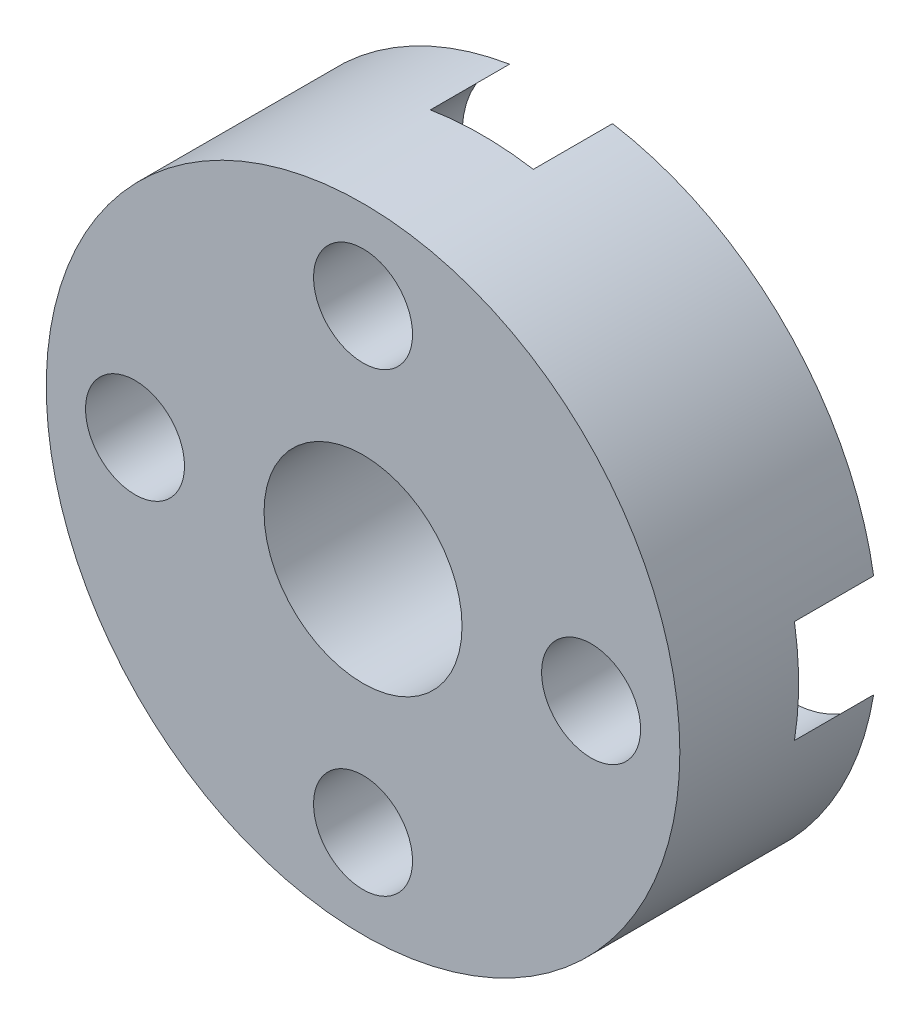
ISO-10303-21;
HEADER;
FILE_DESCRIPTION(('STEP AP214'),'2;1');
FILE_NAME('part.step','',(''),(''),'','','');
FILE_SCHEMA(('AUTOMOTIVE_DESIGN { 1 0 10303 214 1 1 1 1 }'));
ENDSEC;
DATA;
#1=APPLICATION_CONTEXT('core data for automotive mechanical design processes');
#2=APPLICATION_PROTOCOL_DEFINITION('international standard','automotive_design',2000,#1);
#3=PRODUCT_CONTEXT('',#1,'mechanical');
#4=PRODUCT('Part','Part','',(#3));
#5=PRODUCT_RELATED_PRODUCT_CATEGORY('part','',(#4));
#6=PRODUCT_DEFINITION_FORMATION('','',#4);
#7=PRODUCT_DEFINITION_CONTEXT('part definition',#1,'design');
#8=PRODUCT_DEFINITION('design','',#6,#7);
#9=PRODUCT_DEFINITION_SHAPE('','',#8);
#10=(LENGTH_UNIT() NAMED_UNIT(*) SI_UNIT(.MILLI.,.METRE.));
#11=(NAMED_UNIT(*) PLANE_ANGLE_UNIT() SI_UNIT($,.RADIAN.));
#12=(NAMED_UNIT(*) SI_UNIT($,.STERADIAN.) SOLID_ANGLE_UNIT());
#13=UNCERTAINTY_MEASURE_WITH_UNIT(LENGTH_MEASURE(1.E-05),#10,'distance_accuracy_value','');
#14=(GEOMETRIC_REPRESENTATION_CONTEXT(3) GLOBAL_UNCERTAINTY_ASSIGNED_CONTEXT((#13)) GLOBAL_UNIT_ASSIGNED_CONTEXT((#10,
#11,#12)) REPRESENTATION_CONTEXT('',''));
#15=CARTESIAN_POINT('',(0.,0.,0.));
#16=DIRECTION('',(0.,0.,1.));
#17=DIRECTION('',(1.,0.,0.));
#18=AXIS2_PLACEMENT_3D('',#15,#16,#17);
#19=CARTESIAN_POINT('',(-420.454135705833,67.4246299468758,5.));
#20=DIRECTION('',(0.,0.,-1.));
#21=DIRECTION('',(-1.,0.,0.));
#22=AXIS2_PLACEMENT_3D('',#19,#20,#21);
#23=CYLINDRICAL_SURFACE('',#22,1.24999999999995);
#24=CARTESIAN_POINT('',(-420.454135705833,67.4246299468758,5.));
#25=DIRECTION('',(0.,0.,1.));
#26=DIRECTION('',(1.,0.,0.));
#27=AXIS2_PLACEMENT_3D('',#24,#25,#26);
#28=CIRCLE('',#27,1.24999999999995);
#29=CARTESIAN_POINT('',(-419.204135705833,67.4246299468758,5.));
#30=VERTEX_POINT('',#29);
#31=EDGE_CURVE('E180',#30,#30,#28,.T.);
#32=ORIENTED_EDGE('',*,*,#31,.T.);
#33=EDGE_LOOP('',(#32));
#34=FACE_BOUND('',#33,.T.);
#35=CARTESIAN_POINT('',(-420.454135705833,67.4246299468758,2.));
#36=DIRECTION('',(0.,0.,-1.));
#37=DIRECTION('',(-1.,0.,0.));
#38=AXIS2_PLACEMENT_3D('',#35,#36,#37);
#39=CIRCLE('',#38,1.24999999999995);
#40=CARTESIAN_POINT('',(-421.704135705833,67.4246299468758,2.));
#41=VERTEX_POINT('',#40);
#42=EDGE_CURVE('E147',#41,#41,#39,.T.);
#43=ORIENTED_EDGE('',*,*,#42,.T.);
#44=EDGE_LOOP('',(#43));
#45=FACE_BOUND('',#44,.T.);
#46=ADVANCED_FACE('F38',(#34,#45),#23,.F.);
#47=CARTESIAN_POINT('',(-414.695869084725,61.6663633257672,5.));
#48=DIRECTION('',(0.,0.,-1.));
#49=DIRECTION('',(-1.,0.,0.));
#50=AXIS2_PLACEMENT_3D('',#47,#48,#49);
#51=CYLINDRICAL_SURFACE('',#50,1.24999999999996);
#52=CARTESIAN_POINT('',(-414.695869084725,61.6663633257672,5.));
#53=DIRECTION('',(0.,0.,1.));
#54=DIRECTION('',(1.,0.,0.));
#55=AXIS2_PLACEMENT_3D('',#52,#53,#54);
#56=CIRCLE('',#55,1.24999999999996);
#57=CARTESIAN_POINT('',(-413.445869084725,61.6663633257672,5.));
#58=VERTEX_POINT('',#57);
#59=EDGE_CURVE('E177',#58,#58,#56,.T.);
#60=ORIENTED_EDGE('',*,*,#59,.T.);
#61=EDGE_LOOP('',(#60));
#62=FACE_BOUND('',#61,.T.);
#63=CARTESIAN_POINT('',(-414.695869084725,61.6663633257672,2.));
#64=DIRECTION('',(0.,0.,-1.));
#65=DIRECTION('',(-1.,0.,0.));
#66=AXIS2_PLACEMENT_3D('',#63,#64,#65);
#67=CIRCLE('',#66,1.24999999999996);
#68=CARTESIAN_POINT('',(-415.945869084725,61.6663633257672,2.));
#69=VERTEX_POINT('',#68);
#70=EDGE_CURVE('E143',#69,#69,#67,.T.);
#71=ORIENTED_EDGE('',*,*,#70,.T.);
#72=EDGE_LOOP('',(#71));
#73=FACE_BOUND('',#72,.T.);
#74=ADVANCED_FACE('F202',(#62,#73),#51,.F.);
#75=CARTESIAN_POINT('',(-420.454135705833,55.9080967046586,5.));
#76=DIRECTION('',(0.,0.,-1.));
#77=DIRECTION('',(-1.,0.,0.));
#78=AXIS2_PLACEMENT_3D('',#75,#76,#77);
#79=CYLINDRICAL_SURFACE('',#78,1.24999999999996);
#80=CARTESIAN_POINT('',(-420.454135705833,55.9080967046586,5.));
#81=DIRECTION('',(0.,0.,1.));
#82=DIRECTION('',(1.,0.,0.));
#83=AXIS2_PLACEMENT_3D('',#80,#81,#82);
#84=CIRCLE('',#83,1.24999999999996);
#85=CARTESIAN_POINT('',(-419.204135705833,55.9080967046586,5.));
#86=VERTEX_POINT('',#85);
#87=EDGE_CURVE('E174',#86,#86,#84,.T.);
#88=ORIENTED_EDGE('',*,*,#87,.T.);
#89=EDGE_LOOP('',(#88));
#90=FACE_BOUND('',#89,.T.);
#91=CARTESIAN_POINT('',(-420.454135705833,55.9080967046586,2.));
#92=DIRECTION('',(0.,0.,-1.));
#93=DIRECTION('',(-1.,0.,0.));
#94=AXIS2_PLACEMENT_3D('',#91,#92,#93);
#95=CIRCLE('',#94,1.24999999999996);
#96=CARTESIAN_POINT('',(-421.704135705833,55.9080967046586,2.));
#97=VERTEX_POINT('',#96);
#98=EDGE_CURVE('E139',#97,#97,#95,.T.);
#99=ORIENTED_EDGE('',*,*,#98,.T.);
#100=EDGE_LOOP('',(#99));
#101=FACE_BOUND('',#100,.T.);
#102=ADVANCED_FACE('F207',(#90,#101),#79,.F.);
#103=CARTESIAN_POINT('',(-426.212402326942,61.6663633257672,5.));
#104=DIRECTION('',(0.,0.,-1.));
#105=DIRECTION('',(-1.,0.,0.));
#106=AXIS2_PLACEMENT_3D('',#103,#104,#105);
#107=CYLINDRICAL_SURFACE('',#106,1.24999999999996);
#108=CARTESIAN_POINT('',(-426.212402326942,61.6663633257672,5.));
#109=DIRECTION('',(0.,0.,1.));
#110=DIRECTION('',(1.,0.,0.));
#111=AXIS2_PLACEMENT_3D('',#108,#109,#110);
#112=CIRCLE('',#111,1.24999999999996);
#113=CARTESIAN_POINT('',(-424.962402326942,61.6663633257672,5.));
#114=VERTEX_POINT('',#113);
#115=EDGE_CURVE('E171',#114,#114,#112,.T.);
#116=ORIENTED_EDGE('',*,*,#115,.T.);
#117=EDGE_LOOP('',(#116));
#118=FACE_BOUND('',#117,.T.);
#119=CARTESIAN_POINT('',(-426.212402326942,61.6663633257672,2.));
#120=DIRECTION('',(0.,0.,-1.));
#121=DIRECTION('',(-1.,0.,0.));
#122=AXIS2_PLACEMENT_3D('',#119,#120,#121);
#123=CIRCLE('',#122,1.24999999999996);
#124=CARTESIAN_POINT('',(-427.462402326942,61.6663633257672,2.));
#125=VERTEX_POINT('',#124);
#126=EDGE_CURVE('E135',#125,#125,#123,.T.);
#127=ORIENTED_EDGE('',*,*,#126,.T.);
#128=EDGE_LOOP('',(#127));
#129=FACE_BOUND('',#128,.T.);
#130=ADVANCED_FACE('F214',(#118,#129),#107,.F.);
#131=CARTESIAN_POINT('',(-420.454135705833,61.6663633257672,5.));
#132=DIRECTION('',(0.,0.,1.));
#133=DIRECTION('',(1.,0.,0.));
#134=AXIS2_PLACEMENT_3D('',#131,#132,#133);
#135=PLANE('',#134);
#136=ORIENTED_EDGE('',*,*,#87,.F.);
#137=EDGE_LOOP('',(#136));
#138=FACE_BOUND('',#137,.T.);
#139=ORIENTED_EDGE('',*,*,#31,.F.);
#140=EDGE_LOOP('',(#139));
#141=FACE_BOUND('',#140,.T.);
#142=CARTESIAN_POINT('',(-420.454135705833,61.6663633257672,5.));
#143=DIRECTION('',(0.,0.,1.));
#144=DIRECTION('',(1.,0.,0.));
#145=AXIS2_PLACEMENT_3D('',#142,#143,#144);
#146=CIRCLE('',#145,7.99999999999998);
#147=CARTESIAN_POINT('',(-412.454135705833,61.6663633257672,5.));
#148=VERTEX_POINT('',#147);
#149=EDGE_CURVE('E130',#148,#148,#146,.T.);
#150=ORIENTED_EDGE('',*,*,#149,.T.);
#151=EDGE_LOOP('',(#150));
#152=FACE_BOUND('',#151,.T.);
#153=CARTESIAN_POINT('',(-420.454135705833,61.6663633257672,5.));
#154=DIRECTION('',(0.,0.,1.));
#155=DIRECTION('',(1.,0.,0.));
#156=AXIS2_PLACEMENT_3D('',#153,#154,#155);
#157=CIRCLE('',#156,2.50000000000002);
#158=CARTESIAN_POINT('',(-417.954135705833,61.6663633257672,5.));
#159=VERTEX_POINT('',#158);
#160=EDGE_CURVE('E184',#159,#159,#157,.T.);
#161=ORIENTED_EDGE('',*,*,#160,.F.);
#162=EDGE_LOOP('',(#161));
#163=FACE_BOUND('',#162,.T.);
#164=ORIENTED_EDGE('',*,*,#59,.F.);
#165=EDGE_LOOP('',(#164));
#166=FACE_BOUND('',#165,.T.);
#167=ORIENTED_EDGE('',*,*,#115,.F.);
#168=EDGE_LOOP('',(#167));
#169=FACE_BOUND('',#168,.T.);
#170=ADVANCED_FACE('F218',(#138,#141,#152,#163,#166,#169),#135,.T.);
#171=CARTESIAN_POINT('',(-420.454135705833,61.6663633257672,0.));
#172=DIRECTION('',(0.,0.,1.));
#173=DIRECTION('',(1.,0.,0.));
#174=AXIS2_PLACEMENT_3D('',#171,#172,#173);
#175=PLANE('',#174);
#176=CARTESIAN_POINT('',(-420.454135705833,61.6663633257672,0.));
#177=DIRECTION('',(0.,0.,1.));
#178=DIRECTION('',(1.,0.,0.));
#179=AXIS2_PLACEMENT_3D('',#176,#177,#178);
#180=CIRCLE('',#179,7.99999999999998);
#181=CARTESIAN_POINT('',(-421.75416705637,69.5600265113624,0.));
#182=VERTEX_POINT('',#181);
#183=CARTESIAN_POINT('',(-428.347798891428,62.9663946763041,0.));
#184=VERTEX_POINT('',#183);
#185=EDGE_CURVE('E118',#182,#184,#180,.T.);
#186=ORIENTED_EDGE('',*,*,#185,.F.);
#187=CARTESIAN_POINT('',(-420.454135705833,67.4246299468758,0.));
#188=DIRECTION('',(0.,0.,-1.));
#189=DIRECTION('',(-1.,0.,0.));
#190=AXIS2_PLACEMENT_3D('',#187,#188,#189);
#191=CIRCLE('',#190,2.50000000000002);
#192=CARTESIAN_POINT('',(-419.154104355296,69.5600265113624,0.));
#193=VERTEX_POINT('',#192);
#194=EDGE_CURVE('E122',#193,#182,#191,.T.);
#195=ORIENTED_EDGE('',*,*,#194,.F.);
#196=CARTESIAN_POINT('',(-412.560472520238,62.9663946763041,0.));
#197=VERTEX_POINT('',#196);
#198=EDGE_CURVE('E128',#197,#193,#180,.T.);
#199=ORIENTED_EDGE('',*,*,#198,.F.);
#200=CARTESIAN_POINT('',(-414.695869084725,61.6663633257672,0.));
#201=DIRECTION('',(0.,0.,-1.));
#202=DIRECTION('',(-1.,0.,0.));
#203=AXIS2_PLACEMENT_3D('',#200,#201,#202);
#204=CIRCLE('',#203,2.50000000000002);
#205=CARTESIAN_POINT('',(-412.560472520238,60.3663319752303,0.));
#206=VERTEX_POINT('',#205);
#207=EDGE_CURVE('E255',#206,#197,#204,.T.);
#208=ORIENTED_EDGE('',*,*,#207,.F.);
#209=CARTESIAN_POINT('',(-419.154104355296,53.772700140172,0.));
#210=VERTEX_POINT('',#209);
#211=EDGE_CURVE('E131',#210,#206,#180,.T.);
#212=ORIENTED_EDGE('',*,*,#211,.F.);
#213=CARTESIAN_POINT('',(-420.454135705833,55.9080967046586,0.));
#214=DIRECTION('',(0.,0.,-1.));
#215=DIRECTION('',(-1.,0.,0.));
#216=AXIS2_PLACEMENT_3D('',#213,#214,#215);
#217=CIRCLE('',#216,2.50000000000002);
#218=CARTESIAN_POINT('',(-421.75416705637,53.772700140172,0.));
#219=VERTEX_POINT('',#218);
#220=EDGE_CURVE('E260',#219,#210,#217,.T.);
#221=ORIENTED_EDGE('',*,*,#220,.F.);
#222=CARTESIAN_POINT('',(-428.347798891428,60.3663319752303,0.));
#223=VERTEX_POINT('',#222);
#224=EDGE_CURVE('E121',#223,#219,#180,.T.);
#225=ORIENTED_EDGE('',*,*,#224,.F.);
#226=CARTESIAN_POINT('',(-426.212402326942,61.6663633257672,0.));
#227=DIRECTION('',(0.,0.,-1.));
#228=DIRECTION('',(-1.,0.,0.));
#229=AXIS2_PLACEMENT_3D('',#226,#227,#228);
#230=CIRCLE('',#229,2.50000000000002);
#231=EDGE_CURVE('E105',#184,#223,#230,.T.);
#232=ORIENTED_EDGE('',*,*,#231,.F.);
#233=EDGE_LOOP('',(#186,#195,#199,#208,#212,#221,#225,#232));
#234=FACE_BOUND('',#233,.T.);
#235=CARTESIAN_POINT('',(-420.454135705833,61.6663633257672,0.));
#236=DIRECTION('',(0.,0.,1.));
#237=DIRECTION('',(1.,0.,0.));
#238=AXIS2_PLACEMENT_3D('',#235,#236,#237);
#239=CIRCLE('',#238,2.50000000000002);
#240=CARTESIAN_POINT('',(-417.954135705833,61.6663633257672,0.));
#241=VERTEX_POINT('',#240);
#242=EDGE_CURVE('E183',#241,#241,#239,.T.);
#243=ORIENTED_EDGE('',*,*,#242,.T.);
#244=EDGE_LOOP('',(#243));
#245=FACE_BOUND('',#244,.T.);
#246=ADVANCED_FACE('F115',(#234,#245),#175,.F.);
#247=CARTESIAN_POINT('',(-420.454135705833,61.6663633257672,5.));
#248=DIRECTION('',(0.,0.,-1.));
#249=DIRECTION('',(-1.,0.,0.));
#250=AXIS2_PLACEMENT_3D('',#247,#248,#249);
#251=CYLINDRICAL_SURFACE('',#250,7.99999999999998);
#252=ORIENTED_EDGE('',*,*,#198,.T.);
#253=DIRECTION('',(0.,0.,-1.));
#254=VECTOR('',#253,1.);
#255=CARTESIAN_POINT('',(-419.154104355296,69.5600265113624,1.));
#256=LINE('',#255,#254);
#257=CARTESIAN_POINT('',(-419.154104355296,69.5600265113624,2.));
#258=VERTEX_POINT('',#257);
#259=EDGE_CURVE('E11',#193,#258,#256,.F.);
#260=ORIENTED_EDGE('',*,*,#259,.T.);
#261=CARTESIAN_POINT('',(-420.454135705833,61.6663633257672,2.));
#262=DIRECTION('',(0.,0.,-1.));
#263=DIRECTION('',(-1.,0.,0.));
#264=AXIS2_PLACEMENT_3D('',#261,#262,#263);
#265=CIRCLE('',#264,7.99999999999998);
#266=CARTESIAN_POINT('',(-421.75416705637,69.5600265113624,2.));
#267=VERTEX_POINT('',#266);
#268=EDGE_CURVE('E150',#267,#258,#265,.T.);
#269=ORIENTED_EDGE('',*,*,#268,.F.);
#270=DIRECTION('',(0.,0.,-1.));
#271=VECTOR('',#270,1.);
#272=CARTESIAN_POINT('',(-421.75416705637,69.5600265113624,1.));
#273=LINE('',#272,#271);
#274=EDGE_CURVE('E46',#267,#182,#273,.T.);
#275=ORIENTED_EDGE('',*,*,#274,.T.);
#276=ORIENTED_EDGE('',*,*,#185,.T.);
#277=DIRECTION('',(0.,0.,-1.));
#278=VECTOR('',#277,1.);
#279=CARTESIAN_POINT('',(-428.347798891428,62.9663946763041,1.));
#280=LINE('',#279,#278);
#281=CARTESIAN_POINT('',(-428.347798891428,62.9663946763041,2.));
#282=VERTEX_POINT('',#281);
#283=EDGE_CURVE('E102',#184,#282,#280,.F.);
#284=ORIENTED_EDGE('',*,*,#283,.T.);
#285=CARTESIAN_POINT('',(-420.454135705833,61.6663633257672,2.));
#286=DIRECTION('',(0.,0.,-1.));
#287=DIRECTION('',(-1.,0.,0.));
#288=AXIS2_PLACEMENT_3D('',#285,#286,#287);
#289=CIRCLE('',#288,7.99999999999998);
#290=CARTESIAN_POINT('',(-428.347798891428,60.3663319752303,2.));
#291=VERTEX_POINT('',#290);
#292=EDGE_CURVE('E138',#291,#282,#289,.T.);
#293=ORIENTED_EDGE('',*,*,#292,.F.);
#294=DIRECTION('',(0.,0.,-1.));
#295=VECTOR('',#294,1.);
#296=CARTESIAN_POINT('',(-428.347798891428,60.3663319752303,1.));
#297=LINE('',#296,#295);
#298=EDGE_CURVE('E110',#291,#223,#297,.T.);
#299=ORIENTED_EDGE('',*,*,#298,.T.);
#300=ORIENTED_EDGE('',*,*,#224,.T.);
#301=DIRECTION('',(0.,0.,-1.));
#302=VECTOR('',#301,1.);
#303=CARTESIAN_POINT('',(-421.75416705637,53.772700140172,1.));
#304=LINE('',#303,#302);
#305=CARTESIAN_POINT('',(-421.75416705637,53.772700140172,2.));
#306=VERTEX_POINT('',#305);
#307=EDGE_CURVE('E160',#219,#306,#304,.F.);
#308=ORIENTED_EDGE('',*,*,#307,.T.);
#309=CARTESIAN_POINT('',(-420.454135705833,61.6663633257672,2.));
#310=DIRECTION('',(0.,0.,-1.));
#311=DIRECTION('',(-1.,0.,0.));
#312=AXIS2_PLACEMENT_3D('',#309,#310,#311);
#313=CIRCLE('',#312,7.99999999999998);
#314=CARTESIAN_POINT('',(-419.154104355296,53.772700140172,2.));
#315=VERTEX_POINT('',#314);
#316=EDGE_CURVE('E142',#315,#306,#313,.T.);
#317=ORIENTED_EDGE('',*,*,#316,.F.);
#318=DIRECTION('',(0.,0.,-1.));
#319=VECTOR('',#318,1.);
#320=CARTESIAN_POINT('',(-419.154104355296,53.772700140172,1.));
#321=LINE('',#320,#319);
#322=EDGE_CURVE('E157',#315,#210,#321,.T.);
#323=ORIENTED_EDGE('',*,*,#322,.T.);
#324=ORIENTED_EDGE('',*,*,#211,.T.);
#325=DIRECTION('',(0.,0.,-1.));
#326=VECTOR('',#325,1.);
#327=CARTESIAN_POINT('',(-412.560472520238,60.3663319752303,1.));
#328=LINE('',#327,#326);
#329=CARTESIAN_POINT('',(-412.560472520238,60.3663319752303,2.));
#330=VERTEX_POINT('',#329);
#331=EDGE_CURVE('E154',#206,#330,#328,.F.);
#332=ORIENTED_EDGE('',*,*,#331,.T.);
#333=CARTESIAN_POINT('',(-420.454135705833,61.6663633257672,2.));
#334=DIRECTION('',(0.,0.,-1.));
#335=DIRECTION('',(-1.,0.,0.));
#336=AXIS2_PLACEMENT_3D('',#333,#334,#335);
#337=CIRCLE('',#336,7.99999999999998);
#338=CARTESIAN_POINT('',(-412.560472520238,62.9663946763041,2.));
#339=VERTEX_POINT('',#338);
#340=EDGE_CURVE('E146',#339,#330,#337,.T.);
#341=ORIENTED_EDGE('',*,*,#340,.F.);
#342=DIRECTION('',(0.,0.,-1.));
#343=VECTOR('',#342,1.);
#344=CARTESIAN_POINT('',(-412.560472520238,62.9663946763041,1.));
#345=LINE('',#344,#343);
#346=EDGE_CURVE('E151',#339,#197,#345,.T.);
#347=ORIENTED_EDGE('',*,*,#346,.T.);
#348=EDGE_LOOP('',(#252,#260,#269,#275,#276,#284,#293,#299,#300,#308,#317,#323,#324,#332,#341,#347));
#349=FACE_BOUND('',#348,.T.);
#350=ORIENTED_EDGE('',*,*,#149,.F.);
#351=EDGE_LOOP('',(#350));
#352=FACE_BOUND('',#351,.T.);
#353=ADVANCED_FACE('F40',(#349,#352),#251,.T.);
#354=CARTESIAN_POINT('',(-420.454135705833,61.6663633257672,5.));
#355=DIRECTION('',(0.,0.,-1.));
#356=DIRECTION('',(-1.,0.,0.));
#357=AXIS2_PLACEMENT_3D('',#354,#355,#356);
#358=CYLINDRICAL_SURFACE('',#357,2.50000000000002);
#359=ORIENTED_EDGE('',*,*,#160,.T.);
#360=EDGE_LOOP('',(#359));
#361=FACE_BOUND('',#360,.T.);
#362=ORIENTED_EDGE('',*,*,#242,.F.);
#363=EDGE_LOOP('',(#362));
#364=FACE_BOUND('',#363,.T.);
#365=ADVANCED_FACE('F189',(#361,#364),#358,.F.);
#366=CARTESIAN_POINT('',(-426.212402326942,61.6663633257672,2.));
#367=DIRECTION('',(0.,0.,-1.));
#368=DIRECTION('',(-1.,0.,0.));
#369=AXIS2_PLACEMENT_3D('',#366,#367,#368);
#370=CYLINDRICAL_SURFACE('',#369,2.50000000000002);
#371=ORIENTED_EDGE('',*,*,#231,.T.);
#372=ORIENTED_EDGE('',*,*,#298,.F.);
#373=CARTESIAN_POINT('',(-426.212402326942,61.6663633257672,2.));
#374=DIRECTION('',(0.,0.,-1.));
#375=DIRECTION('',(-1.,0.,0.));
#376=AXIS2_PLACEMENT_3D('',#373,#374,#375);
#377=CIRCLE('',#376,2.50000000000002);
#378=EDGE_CURVE('E59',#282,#291,#377,.T.);
#379=ORIENTED_EDGE('',*,*,#378,.F.);
#380=ORIENTED_EDGE('',*,*,#283,.F.);
#381=EDGE_LOOP('',(#371,#372,#379,#380));
#382=FACE_BOUND('',#381,.T.);
#383=ADVANCED_FACE('F104',(#382),#370,.F.);
#384=CARTESIAN_POINT('',(-426.212402326942,61.6663633257672,2.));
#385=DIRECTION('',(0.,0.,-1.));
#386=DIRECTION('',(-1.,0.,0.));
#387=AXIS2_PLACEMENT_3D('',#384,#385,#386);
#388=PLANE('',#387);
#389=ORIENTED_EDGE('',*,*,#126,.F.);
#390=EDGE_LOOP('',(#389));
#391=FACE_BOUND('',#390,.T.);
#392=ORIENTED_EDGE('',*,*,#292,.T.);
#393=ORIENTED_EDGE('',*,*,#378,.T.);
#394=EDGE_LOOP('',(#392,#393));
#395=FACE_BOUND('',#394,.T.);
#396=ADVANCED_FACE('F197',(#391,#395),#388,.T.);
#397=CARTESIAN_POINT('',(-420.454135705833,55.9080967046586,2.));
#398=DIRECTION('',(0.,0.,-1.));
#399=DIRECTION('',(-1.,0.,0.));
#400=AXIS2_PLACEMENT_3D('',#397,#398,#399);
#401=CYLINDRICAL_SURFACE('',#400,2.50000000000002);
#402=ORIENTED_EDGE('',*,*,#220,.T.);
#403=ORIENTED_EDGE('',*,*,#322,.F.);
#404=CARTESIAN_POINT('',(-420.454135705833,55.9080967046586,2.));
#405=DIRECTION('',(0.,0.,-1.));
#406=DIRECTION('',(-1.,0.,0.));
#407=AXIS2_PLACEMENT_3D('',#404,#405,#406);
#408=CIRCLE('',#407,2.50000000000002);
#409=EDGE_CURVE('E262',#306,#315,#408,.T.);
#410=ORIENTED_EDGE('',*,*,#409,.F.);
#411=ORIENTED_EDGE('',*,*,#307,.F.);
#412=EDGE_LOOP('',(#402,#403,#410,#411));
#413=FACE_BOUND('',#412,.T.);
#414=ADVANCED_FACE('F232',(#413),#401,.F.);
#415=CARTESIAN_POINT('',(-420.454135705833,55.9080967046586,2.));
#416=DIRECTION('',(0.,0.,-1.));
#417=DIRECTION('',(-1.,0.,0.));
#418=AXIS2_PLACEMENT_3D('',#415,#416,#417);
#419=PLANE('',#418);
#420=ORIENTED_EDGE('',*,*,#98,.F.);
#421=EDGE_LOOP('',(#420));
#422=FACE_BOUND('',#421,.T.);
#423=ORIENTED_EDGE('',*,*,#316,.T.);
#424=ORIENTED_EDGE('',*,*,#409,.T.);
#425=EDGE_LOOP('',(#423,#424));
#426=FACE_BOUND('',#425,.T.);
#427=ADVANCED_FACE('F228',(#422,#426),#419,.T.);
#428=CARTESIAN_POINT('',(-414.695869084725,61.6663633257672,2.));
#429=DIRECTION('',(0.,0.,-1.));
#430=DIRECTION('',(-1.,0.,0.));
#431=AXIS2_PLACEMENT_3D('',#428,#429,#430);
#432=CYLINDRICAL_SURFACE('',#431,2.50000000000002);
#433=ORIENTED_EDGE('',*,*,#207,.T.);
#434=ORIENTED_EDGE('',*,*,#346,.F.);
#435=CARTESIAN_POINT('',(-414.695869084725,61.6663633257672,2.));
#436=DIRECTION('',(0.,0.,-1.));
#437=DIRECTION('',(-1.,0.,0.));
#438=AXIS2_PLACEMENT_3D('',#435,#436,#437);
#439=CIRCLE('',#438,2.50000000000002);
#440=EDGE_CURVE('E166',#330,#339,#439,.T.);
#441=ORIENTED_EDGE('',*,*,#440,.F.);
#442=ORIENTED_EDGE('',*,*,#331,.F.);
#443=EDGE_LOOP('',(#433,#434,#441,#442));
#444=FACE_BOUND('',#443,.T.);
#445=ADVANCED_FACE('F224',(#444),#432,.F.);
#446=CARTESIAN_POINT('',(-414.695869084725,61.6663633257672,2.));
#447=DIRECTION('',(0.,0.,-1.));
#448=DIRECTION('',(-1.,0.,0.));
#449=AXIS2_PLACEMENT_3D('',#446,#447,#448);
#450=PLANE('',#449);
#451=ORIENTED_EDGE('',*,*,#70,.F.);
#452=EDGE_LOOP('',(#451));
#453=FACE_BOUND('',#452,.T.);
#454=ORIENTED_EDGE('',*,*,#340,.T.);
#455=ORIENTED_EDGE('',*,*,#440,.T.);
#456=EDGE_LOOP('',(#454,#455));
#457=FACE_BOUND('',#456,.T.);
#458=ADVANCED_FACE('F220',(#453,#457),#450,.T.);
#459=CARTESIAN_POINT('',(-420.454135705833,67.4246299468758,2.));
#460=DIRECTION('',(0.,0.,-1.));
#461=DIRECTION('',(-1.,0.,0.));
#462=AXIS2_PLACEMENT_3D('',#459,#460,#461);
#463=CYLINDRICAL_SURFACE('',#462,2.50000000000002);
#464=ORIENTED_EDGE('',*,*,#194,.T.);
#465=ORIENTED_EDGE('',*,*,#274,.F.);
#466=CARTESIAN_POINT('',(-420.454135705833,67.4246299468758,2.));
#467=DIRECTION('',(0.,0.,-1.));
#468=DIRECTION('',(-1.,0.,0.));
#469=AXIS2_PLACEMENT_3D('',#466,#467,#468);
#470=CIRCLE('',#469,2.50000000000002);
#471=EDGE_CURVE('E52',#258,#267,#470,.T.);
#472=ORIENTED_EDGE('',*,*,#471,.F.);
#473=ORIENTED_EDGE('',*,*,#259,.F.);
#474=EDGE_LOOP('',(#464,#465,#472,#473));
#475=FACE_BOUND('',#474,.T.);
#476=ADVANCED_FACE('F223',(#475),#463,.F.);
#477=CARTESIAN_POINT('',(-420.454135705833,67.4246299468758,2.));
#478=DIRECTION('',(0.,0.,-1.));
#479=DIRECTION('',(-1.,0.,0.));
#480=AXIS2_PLACEMENT_3D('',#477,#478,#479);
#481=PLANE('',#480);
#482=ORIENTED_EDGE('',*,*,#42,.F.);
#483=EDGE_LOOP('',(#482));
#484=FACE_BOUND('',#483,.T.);
#485=ORIENTED_EDGE('',*,*,#268,.T.);
#486=ORIENTED_EDGE('',*,*,#471,.T.);
#487=EDGE_LOOP('',(#485,#486));
#488=FACE_BOUND('',#487,.T.);
#489=ADVANCED_FACE('F242',(#484,#488),#481,.T.);
#490=CLOSED_SHELL('',(#46,#74,#102,#130,#170,#246,#353,#365,#383,#396,#414,#427,#445,#458,#476,#489));
#491=MANIFOLD_SOLID_BREP('B2',#490);
#492=ADVANCED_BREP_SHAPE_REPRESENTATION('',(#18,#491),#14);
#493=SHAPE_DEFINITION_REPRESENTATION(#9,#492);
ENDSEC;
END-ISO-10303-21;
